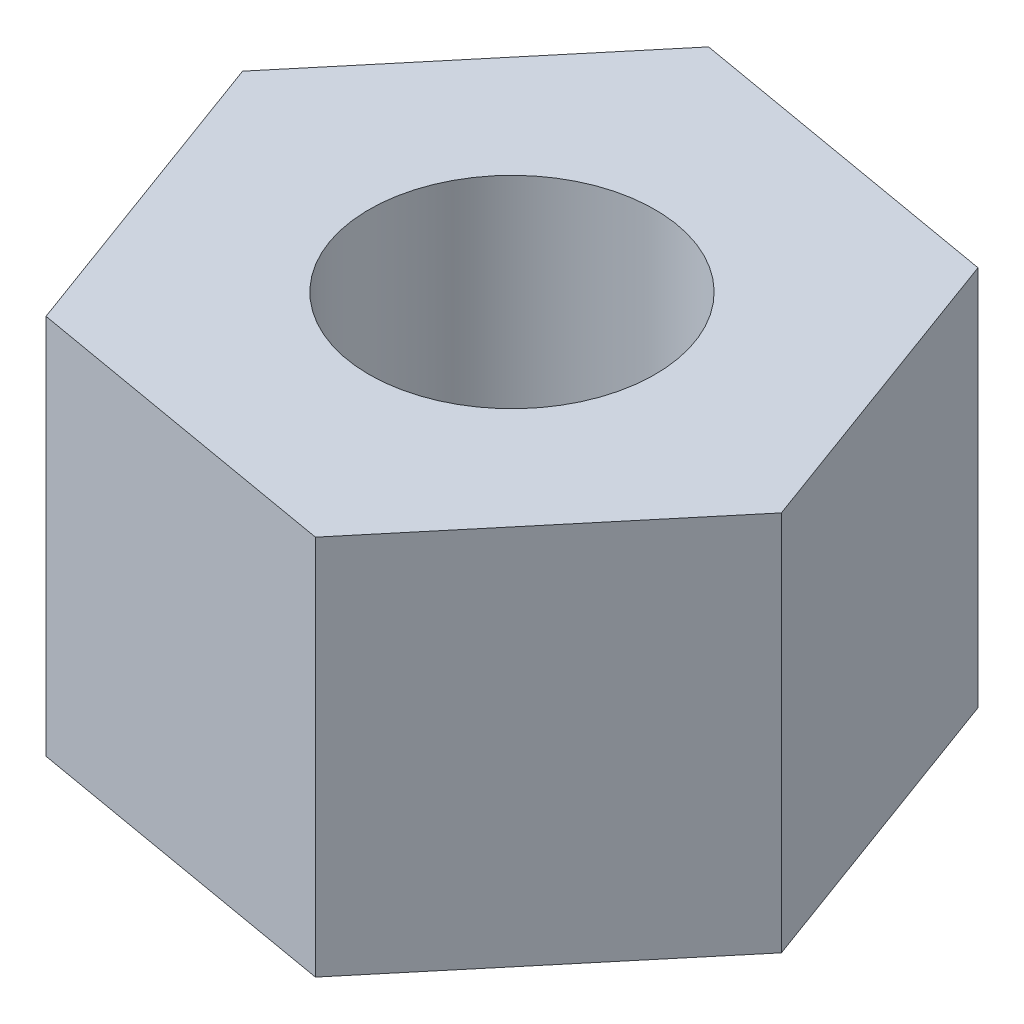
ISO-10303-21;
HEADER;
FILE_DESCRIPTION(('STEP AP214'),'2;1');
FILE_NAME('part.step','',(''),(''),'','','');
FILE_SCHEMA(('AUTOMOTIVE_DESIGN { 1 0 10303 214 1 1 1 1 }'));
ENDSEC;
DATA;
#1=APPLICATION_CONTEXT('core data for automotive mechanical design processes');
#2=APPLICATION_PROTOCOL_DEFINITION('international standard','automotive_design',2000,#1);
#3=PRODUCT_CONTEXT('',#1,'mechanical');
#4=PRODUCT('Part','Part','',(#3));
#5=PRODUCT_RELATED_PRODUCT_CATEGORY('part','',(#4));
#6=PRODUCT_DEFINITION_FORMATION('','',#4);
#7=PRODUCT_DEFINITION_CONTEXT('part definition',#1,'design');
#8=PRODUCT_DEFINITION('design','',#6,#7);
#9=PRODUCT_DEFINITION_SHAPE('','',#8);
#10=(LENGTH_UNIT() NAMED_UNIT(*) SI_UNIT(.MILLI.,.METRE.));
#11=(NAMED_UNIT(*) PLANE_ANGLE_UNIT() SI_UNIT($,.RADIAN.));
#12=(NAMED_UNIT(*) SI_UNIT($,.STERADIAN.) SOLID_ANGLE_UNIT());
#13=UNCERTAINTY_MEASURE_WITH_UNIT(LENGTH_MEASURE(1.E-05),#10,'distance_accuracy_value','');
#14=(GEOMETRIC_REPRESENTATION_CONTEXT(3) GLOBAL_UNCERTAINTY_ASSIGNED_CONTEXT((#13)) GLOBAL_UNIT_ASSIGNED_CONTEXT((#10,
#11,#12)) REPRESENTATION_CONTEXT('',''));
#15=CARTESIAN_POINT('',(0.,0.,0.));
#16=DIRECTION('',(0.,0.,1.));
#17=DIRECTION('',(1.,0.,0.));
#18=AXIS2_PLACEMENT_3D('',#15,#16,#17);
#19=CARTESIAN_POINT('',(0.883190446356689,1.5875,-1.05838834498383));
#20=DIRECTION('',(-0.170964347340288,0.,0.985277215781685));
#21=DIRECTION('',(0.985277215781685,0.,0.170964347340288));
#22=AXIS2_PLACEMENT_3D('',#19,#20,#21);
#23=PLANE('',#22);
#24=DIRECTION('',(-0.985277215781685,0.,-0.170964347340288));
#25=VECTOR('',#24,1.);
#26=CARTESIAN_POINT('',(0.883190446356689,0.,-1.05838834498383));
#27=LINE('',#26,#25);
#28=CARTESIAN_POINT('',(0.883190446356689,0.,-1.05838834498383));
#29=VERTEX_POINT('',#28);
#30=CARTESIAN_POINT('',(-0.474995970647018,0.,-1.29405953541652));
#31=VERTEX_POINT('',#30);
#32=EDGE_CURVE('E121',#29,#31,#27,.T.);
#33=ORIENTED_EDGE('',*,*,#32,.T.);
#34=DIRECTION('',(0.,-1.,0.));
#35=VECTOR('',#34,1.);
#36=CARTESIAN_POINT('',(-0.474995970647018,1.5875,-1.29405953541652));
#37=LINE('',#36,#35);
#38=CARTESIAN_POINT('',(-0.474995970647018,1.5875,-1.29405953541652));
#39=VERTEX_POINT('',#38);
#40=EDGE_CURVE('E11',#39,#31,#37,.T.);
#41=ORIENTED_EDGE('',*,*,#40,.F.);
#42=DIRECTION('',(-0.985277215781685,0.,-0.170964347340288));
#43=VECTOR('',#42,1.);
#44=CARTESIAN_POINT('',(0.883190446356689,1.5875,-1.05838834498383));
#45=LINE('',#44,#43);
#46=CARTESIAN_POINT('',(0.883190446356689,1.5875,-1.05838834498383));
#47=VERTEX_POINT('',#46);
#48=EDGE_CURVE('E132',#47,#39,#45,.T.);
#49=ORIENTED_EDGE('',*,*,#48,.F.);
#50=DIRECTION('',(0.,-1.,0.));
#51=VECTOR('',#50,1.);
#52=CARTESIAN_POINT('',(0.883190446356689,1.5875,-1.05838834498383));
#53=LINE('',#52,#51);
#54=EDGE_CURVE('E117',#47,#29,#53,.T.);
#55=ORIENTED_EDGE('',*,*,#54,.T.);
#56=EDGE_LOOP('',(#33,#41,#49,#55));
#57=FACE_BOUND('',#56,.T.);
#58=ADVANCED_FACE('F37',(#57),#23,.F.);
#59=CARTESIAN_POINT('',(-0.474995970647018,1.5875,-1.29405953541652));
#60=DIRECTION('',(0.767792924966798,0.,0.640698075828958));
#61=DIRECTION('',(0.640698075828958,0.,-0.767792924966798));
#62=AXIS2_PLACEMENT_3D('',#59,#60,#61);
#63=PLANE('',#62);
#64=DIRECTION('',(-0.640698075828958,0.,0.767792924966798));
#65=VECTOR('',#64,1.);
#66=CARTESIAN_POINT('',(-0.474995970647018,0.,-1.29405953541652));
#67=LINE('',#66,#65);
#68=CARTESIAN_POINT('',(-1.35818641700371,0.,-0.235671190432697));
#69=VERTEX_POINT('',#68);
#70=EDGE_CURVE('E124',#31,#69,#67,.T.);
#71=ORIENTED_EDGE('',*,*,#70,.T.);
#72=DIRECTION('',(0.,-1.,0.));
#73=VECTOR('',#72,1.);
#74=CARTESIAN_POINT('',(-1.35818641700371,1.5875,-0.235671190432697));
#75=LINE('',#74,#73);
#76=CARTESIAN_POINT('',(-1.35818641700371,1.5875,-0.235671190432697));
#77=VERTEX_POINT('',#76);
#78=EDGE_CURVE('E45',#77,#69,#75,.T.);
#79=ORIENTED_EDGE('',*,*,#78,.F.);
#80=DIRECTION('',(-0.640698075828958,0.,0.767792924966798));
#81=VECTOR('',#80,1.);
#82=CARTESIAN_POINT('',(-0.474995970647018,1.5875,-1.29405953541652));
#83=LINE('',#82,#81);
#84=EDGE_CURVE('E90',#39,#77,#83,.T.);
#85=ORIENTED_EDGE('',*,*,#84,.F.);
#86=ORIENTED_EDGE('',*,*,#40,.T.);
#87=EDGE_LOOP('',(#71,#79,#85,#86));
#88=FACE_BOUND('',#87,.T.);
#89=ADVANCED_FACE('F157',(#88),#63,.F.);
#90=CARTESIAN_POINT('',(-1.35818641700371,1.5875,-0.235671190432697));
#91=DIRECTION('',(0.938757272307085,0.,-0.344579139952727));
#92=DIRECTION('',(-0.344579139952727,0.,-0.938757272307085));
#93=AXIS2_PLACEMENT_3D('',#90,#91,#92);
#94=PLANE('',#93);
#95=DIRECTION('',(0.344579139952727,0.,0.938757272307085));
#96=VECTOR('',#95,1.);
#97=CARTESIAN_POINT('',(-1.35818641700371,0.,-0.235671190432697));
#98=LINE('',#97,#96);
#99=CARTESIAN_POINT('',(-0.883190446356689,0.,1.05838834498383));
#100=VERTEX_POINT('',#99);
#101=EDGE_CURVE('E127',#69,#100,#98,.T.);
#102=ORIENTED_EDGE('',*,*,#101,.T.);
#103=DIRECTION('',(0.,-1.,0.));
#104=VECTOR('',#103,1.);
#105=CARTESIAN_POINT('',(-0.883190446356689,1.5875,1.05838834498383));
#106=LINE('',#105,#104);
#107=CARTESIAN_POINT('',(-0.883190446356689,1.5875,1.05838834498383));
#108=VERTEX_POINT('',#107);
#109=EDGE_CURVE('E112',#108,#100,#106,.T.);
#110=ORIENTED_EDGE('',*,*,#109,.F.);
#111=DIRECTION('',(0.344579139952727,0.,0.938757272307085));
#112=VECTOR('',#111,1.);
#113=CARTESIAN_POINT('',(-1.35818641700371,1.5875,-0.235671190432697));
#114=LINE('',#113,#112);
#115=EDGE_CURVE('E103',#77,#108,#114,.T.);
#116=ORIENTED_EDGE('',*,*,#115,.F.);
#117=ORIENTED_EDGE('',*,*,#78,.T.);
#118=EDGE_LOOP('',(#102,#110,#116,#117));
#119=FACE_BOUND('',#118,.T.);
#120=ADVANCED_FACE('F138',(#119),#94,.F.);
#121=CARTESIAN_POINT('',(-0.883190446356689,1.5875,1.05838834498383));
#122=DIRECTION('',(0.170964347340288,0.,-0.985277215781685));
#123=DIRECTION('',(-0.985277215781685,0.,-0.170964347340288));
#124=AXIS2_PLACEMENT_3D('',#121,#122,#123);
#125=PLANE('',#124);
#126=DIRECTION('',(0.985277215781685,0.,0.170964347340288));
#127=VECTOR('',#126,1.);
#128=CARTESIAN_POINT('',(-0.883190446356689,0.,1.05838834498383));
#129=LINE('',#128,#127);
#130=CARTESIAN_POINT('',(0.474995970647018,0.,1.29405953541652));
#131=VERTEX_POINT('',#130);
#132=EDGE_CURVE('E111',#100,#131,#129,.T.);
#133=ORIENTED_EDGE('',*,*,#132,.T.);
#134=DIRECTION('',(0.,-1.,0.));
#135=VECTOR('',#134,1.);
#136=CARTESIAN_POINT('',(0.474995970647018,1.5875,1.29405953541652));
#137=LINE('',#136,#135);
#138=CARTESIAN_POINT('',(0.474995970647018,1.5875,1.29405953541652));
#139=VERTEX_POINT('',#138);
#140=EDGE_CURVE('E108',#139,#131,#137,.T.);
#141=ORIENTED_EDGE('',*,*,#140,.F.);
#142=DIRECTION('',(0.985277215781685,0.,0.170964347340288));
#143=VECTOR('',#142,1.);
#144=CARTESIAN_POINT('',(-0.883190446356689,1.5875,1.05838834498383));
#145=LINE('',#144,#143);
#146=EDGE_CURVE('E97',#108,#139,#145,.T.);
#147=ORIENTED_EDGE('',*,*,#146,.F.);
#148=ORIENTED_EDGE('',*,*,#109,.T.);
#149=EDGE_LOOP('',(#133,#141,#147,#148));
#150=FACE_BOUND('',#149,.T.);
#151=ADVANCED_FACE('F109',(#150),#125,.F.);
#152=CARTESIAN_POINT('',(0.474995970647018,1.5875,1.29405953541652));
#153=DIRECTION('',(-0.767792924966798,0.,-0.640698075828958));
#154=DIRECTION('',(-0.640698075828958,0.,0.767792924966798));
#155=AXIS2_PLACEMENT_3D('',#152,#153,#154);
#156=PLANE('',#155);
#157=DIRECTION('',(0.640698075828958,0.,-0.767792924966798));
#158=VECTOR('',#157,1.);
#159=CARTESIAN_POINT('',(0.474995970647018,0.,1.29405953541652));
#160=LINE('',#159,#158);
#161=CARTESIAN_POINT('',(1.35818641700371,0.,0.235671190432697));
#162=VERTEX_POINT('',#161);
#163=EDGE_CURVE('E76',#131,#162,#160,.T.);
#164=ORIENTED_EDGE('',*,*,#163,.T.);
#165=DIRECTION('',(0.,-1.,0.));
#166=VECTOR('',#165,1.);
#167=CARTESIAN_POINT('',(1.35818641700371,1.5875,0.235671190432697));
#168=LINE('',#167,#166);
#169=CARTESIAN_POINT('',(1.35818641700371,1.5875,0.235671190432697));
#170=VERTEX_POINT('',#169);
#171=EDGE_CURVE('E113',#170,#162,#168,.T.);
#172=ORIENTED_EDGE('',*,*,#171,.F.);
#173=DIRECTION('',(0.640698075828958,0.,-0.767792924966798));
#174=VECTOR('',#173,1.);
#175=CARTESIAN_POINT('',(0.474995970647018,1.5875,1.29405953541652));
#176=LINE('',#175,#174);
#177=EDGE_CURVE('E101',#139,#170,#176,.T.);
#178=ORIENTED_EDGE('',*,*,#177,.F.);
#179=ORIENTED_EDGE('',*,*,#140,.T.);
#180=EDGE_LOOP('',(#164,#172,#178,#179));
#181=FACE_BOUND('',#180,.T.);
#182=ADVANCED_FACE('F115',(#181),#156,.F.);
#183=CARTESIAN_POINT('',(1.35818641700371,1.5875,0.235671190432697));
#184=DIRECTION('',(-0.938757272307085,0.,0.344579139952727));
#185=DIRECTION('',(0.344579139952727,0.,0.938757272307085));
#186=AXIS2_PLACEMENT_3D('',#183,#184,#185);
#187=PLANE('',#186);
#188=DIRECTION('',(-0.344579139952727,0.,-0.938757272307085));
#189=VECTOR('',#188,1.);
#190=CARTESIAN_POINT('',(1.35818641700371,0.,0.235671190432697));
#191=LINE('',#190,#189);
#192=EDGE_CURVE('E82',#162,#29,#191,.T.);
#193=ORIENTED_EDGE('',*,*,#192,.T.);
#194=ORIENTED_EDGE('',*,*,#54,.F.);
#195=DIRECTION('',(-0.344579139952727,0.,-0.938757272307085));
#196=VECTOR('',#195,1.);
#197=CARTESIAN_POINT('',(1.35818641700371,1.5875,0.235671190432697));
#198=LINE('',#197,#196);
#199=EDGE_CURVE('E53',#170,#47,#198,.T.);
#200=ORIENTED_EDGE('',*,*,#199,.F.);
#201=ORIENTED_EDGE('',*,*,#171,.T.);
#202=EDGE_LOOP('',(#193,#194,#200,#201));
#203=FACE_BOUND('',#202,.T.);
#204=ADVANCED_FACE('F145',(#203),#187,.F.);
#205=CARTESIAN_POINT('',(0.,1.5875,0.));
#206=DIRECTION('',(0.,1.,0.));
#207=DIRECTION('',(0.,0.,1.));
#208=AXIS2_PLACEMENT_3D('',#205,#206,#207);
#209=PLANE('',#208);
#210=CARTESIAN_POINT('',(0.,1.5875,0.));
#211=DIRECTION('',(0.,1.,0.));
#212=DIRECTION('',(0.,0.,1.));
#213=AXIS2_PLACEMENT_3D('',#210,#211,#212);
#214=CIRCLE('',#213,0.595629999999999);
#215=CARTESIAN_POINT('',(0.,1.5875,0.595629999999999));
#216=VERTEX_POINT('',#215);
#217=EDGE_CURVE('E214',#216,#216,#214,.T.);
#218=ORIENTED_EDGE('',*,*,#217,.F.);
#219=EDGE_LOOP('',(#218));
#220=FACE_BOUND('',#219,.T.);
#221=ORIENTED_EDGE('',*,*,#48,.T.);
#222=ORIENTED_EDGE('',*,*,#84,.T.);
#223=ORIENTED_EDGE('',*,*,#115,.T.);
#224=ORIENTED_EDGE('',*,*,#146,.T.);
#225=ORIENTED_EDGE('',*,*,#177,.T.);
#226=ORIENTED_EDGE('',*,*,#199,.T.);
#227=EDGE_LOOP('',(#221,#222,#223,#224,#225,#226));
#228=FACE_BOUND('',#227,.T.);
#229=ADVANCED_FACE('F99',(#220,#228),#209,.T.);
#230=CARTESIAN_POINT('',(0.,0.,0.));
#231=DIRECTION('',(0.,1.,0.));
#232=DIRECTION('',(0.,0.,1.));
#233=AXIS2_PLACEMENT_3D('',#230,#231,#232);
#234=PLANE('',#233);
#235=CARTESIAN_POINT('',(0.,0.,0.));
#236=DIRECTION('',(0.,1.,0.));
#237=DIRECTION('',(0.,0.,1.));
#238=AXIS2_PLACEMENT_3D('',#235,#236,#237);
#239=CIRCLE('',#238,0.595629999999999);
#240=CARTESIAN_POINT('',(0.,0.,0.595629999999999));
#241=VERTEX_POINT('',#240);
#242=EDGE_CURVE('E125',#241,#241,#239,.T.);
#243=ORIENTED_EDGE('',*,*,#242,.T.);
#244=EDGE_LOOP('',(#243));
#245=FACE_BOUND('',#244,.T.);
#246=ORIENTED_EDGE('',*,*,#32,.F.);
#247=ORIENTED_EDGE('',*,*,#192,.F.);
#248=ORIENTED_EDGE('',*,*,#163,.F.);
#249=ORIENTED_EDGE('',*,*,#132,.F.);
#250=ORIENTED_EDGE('',*,*,#101,.F.);
#251=ORIENTED_EDGE('',*,*,#70,.F.);
#252=EDGE_LOOP('',(#246,#247,#248,#249,#250,#251));
#253=FACE_BOUND('',#252,.T.);
#254=ADVANCED_FACE('F141',(#245,#253),#234,.F.);
#255=CARTESIAN_POINT('',(0.,1.5875,0.));
#256=DIRECTION('',(0.,1.,0.));
#257=DIRECTION('',(0.,0.,1.));
#258=AXIS2_PLACEMENT_3D('',#255,#256,#257);
#259=CYLINDRICAL_SURFACE('',#258,0.595629999999999);
#260=ORIENTED_EDGE('',*,*,#242,.F.);
#261=EDGE_LOOP('',(#260));
#262=FACE_BOUND('',#261,.T.);
#263=ORIENTED_EDGE('',*,*,#217,.T.);
#264=EDGE_LOOP('',(#263));
#265=FACE_BOUND('',#264,.T.);
#266=ADVANCED_FACE('F194',(#262,#265),#259,.F.);
#267=CLOSED_SHELL('',(#58,#89,#120,#151,#182,#204,#229,#254,#266));
#268=MANIFOLD_SOLID_BREP('B2',#267);
#269=ADVANCED_BREP_SHAPE_REPRESENTATION('',(#18,#268),#14);
#270=SHAPE_DEFINITION_REPRESENTATION(#9,#269);
ENDSEC;
END-ISO-10303-21;
